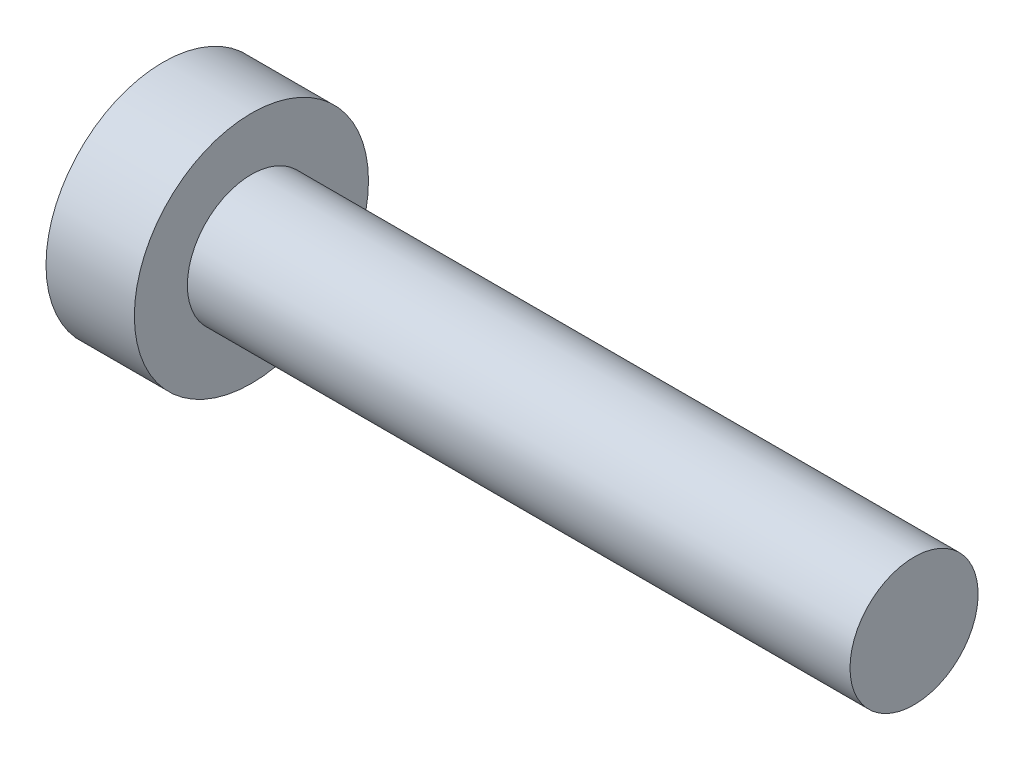
ISO-10303-21;
HEADER;
FILE_DESCRIPTION(('STEP AP214'),'2;1');
FILE_NAME('part.step','',(''),(''),'','','');
FILE_SCHEMA(('AUTOMOTIVE_DESIGN { 1 0 10303 214 1 1 1 1 }'));
ENDSEC;
DATA;
#1=APPLICATION_CONTEXT('core data for automotive mechanical design processes');
#2=APPLICATION_PROTOCOL_DEFINITION('international standard','automotive_design',2000,#1);
#3=PRODUCT_CONTEXT('',#1,'mechanical');
#4=PRODUCT('Part','Part','',(#3));
#5=PRODUCT_RELATED_PRODUCT_CATEGORY('part','',(#4));
#6=PRODUCT_DEFINITION_FORMATION('','',#4);
#7=PRODUCT_DEFINITION_CONTEXT('part definition',#1,'design');
#8=PRODUCT_DEFINITION('design','',#6,#7);
#9=PRODUCT_DEFINITION_SHAPE('','',#8);
#10=(LENGTH_UNIT() NAMED_UNIT(*) SI_UNIT(.MILLI.,.METRE.));
#11=(NAMED_UNIT(*) PLANE_ANGLE_UNIT() SI_UNIT($,.RADIAN.));
#12=(NAMED_UNIT(*) SI_UNIT($,.STERADIAN.) SOLID_ANGLE_UNIT());
#13=UNCERTAINTY_MEASURE_WITH_UNIT(LENGTH_MEASURE(1.E-05),#10,'distance_accuracy_value','');
#14=(GEOMETRIC_REPRESENTATION_CONTEXT(3) GLOBAL_UNCERTAINTY_ASSIGNED_CONTEXT((#13)) GLOBAL_UNIT_ASSIGNED_CONTEXT((#10,
#11,#12)) REPRESENTATION_CONTEXT('',''));
#15=CARTESIAN_POINT('',(0.,0.,0.));
#16=DIRECTION('',(0.,0.,1.));
#17=DIRECTION('',(1.,0.,0.));
#18=AXIS2_PLACEMENT_3D('',#15,#16,#17);
#19=CARTESIAN_POINT('',(0.,0.,0.));
#20=DIRECTION('',(1.,0.,0.));
#21=DIRECTION('',(0.,0.,-1.));
#22=AXIS2_PLACEMENT_3D('',#19,#20,#21);
#23=PLANE('',#22);
#24=CARTESIAN_POINT('',(0.,-1.45,0.));
#25=DIRECTION('',(-1.,0.,0.));
#26=DIRECTION('',(0.,0.,1.));
#27=AXIS2_PLACEMENT_3D('',#24,#25,#26);
#28=CIRCLE('',#27,2.65);
#29=CARTESIAN_POINT('',(0.,-1.45,2.65));
#30=VERTEX_POINT('',#29);
#31=EDGE_CURVE('E10',#30,#30,#28,.T.);
#32=ORIENTED_EDGE('',*,*,#31,.T.);
#33=EDGE_LOOP('',(#32));
#34=FACE_BOUND('',#33,.T.);
#35=ADVANCED_FACE('F32',(#34),#23,.F.);
#36=CARTESIAN_POINT('',(15.9186571646008,-1.45,0.));
#37=DIRECTION('',(-1.,0.,0.));
#38=DIRECTION('',(0.,0.,1.));
#39=AXIS2_PLACEMENT_3D('',#36,#37,#38);
#40=CYLINDRICAL_SURFACE('',#39,2.65);
#41=ORIENTED_EDGE('',*,*,#31,.F.);
#42=EDGE_LOOP('',(#41));
#43=FACE_BOUND('',#42,.T.);
#44=CARTESIAN_POINT('',(2.,-1.45,0.));
#45=DIRECTION('',(-1.,0.,0.));
#46=DIRECTION('',(0.,0.,1.));
#47=AXIS2_PLACEMENT_3D('',#44,#45,#46);
#48=CIRCLE('',#47,2.65);
#49=CARTESIAN_POINT('',(2.,-1.45,2.65));
#50=VERTEX_POINT('',#49);
#51=EDGE_CURVE('E39',#50,#50,#48,.T.);
#52=ORIENTED_EDGE('',*,*,#51,.T.);
#53=EDGE_LOOP('',(#52));
#54=FACE_BOUND('',#53,.T.);
#55=ADVANCED_FACE('F87',(#43,#54),#40,.T.);
#56=CARTESIAN_POINT('',(2.,1.2,0.));
#57=DIRECTION('',(-1.,0.,0.));
#58=DIRECTION('',(0.,0.,1.));
#59=AXIS2_PLACEMENT_3D('',#56,#57,#58);
#60=PLANE('',#59);
#61=ORIENTED_EDGE('',*,*,#51,.F.);
#62=EDGE_LOOP('',(#61));
#63=FACE_BOUND('',#62,.T.);
#64=CARTESIAN_POINT('',(2.,-1.45,0.));
#65=DIRECTION('',(-1.,0.,0.));
#66=DIRECTION('',(0.,0.,1.));
#67=AXIS2_PLACEMENT_3D('',#64,#65,#66);
#68=CIRCLE('',#67,1.45);
#69=CARTESIAN_POINT('',(2.,-1.45,1.45));
#70=VERTEX_POINT('',#69);
#71=EDGE_CURVE('E43',#70,#70,#68,.T.);
#72=ORIENTED_EDGE('',*,*,#71,.T.);
#73=EDGE_LOOP('',(#72));
#74=FACE_BOUND('',#73,.T.);
#75=ADVANCED_FACE('F84',(#63,#74),#60,.F.);
#76=CARTESIAN_POINT('',(15.9186571646008,-1.45,0.));
#77=DIRECTION('',(-1.,0.,0.));
#78=DIRECTION('',(0.,0.,1.));
#79=AXIS2_PLACEMENT_3D('',#76,#77,#78);
#80=CYLINDRICAL_SURFACE('',#79,1.45);
#81=ORIENTED_EDGE('',*,*,#71,.F.);
#82=EDGE_LOOP('',(#81));
#83=FACE_BOUND('',#82,.T.);
#84=CARTESIAN_POINT('',(17.,-1.45,0.));
#85=DIRECTION('',(-1.,0.,0.));
#86=DIRECTION('',(0.,0.,1.));
#87=AXIS2_PLACEMENT_3D('',#84,#85,#86);
#88=CIRCLE('',#87,1.45);
#89=CARTESIAN_POINT('',(17.,-1.45,1.45));
#90=VERTEX_POINT('',#89);
#91=EDGE_CURVE('E47',#90,#90,#88,.T.);
#92=ORIENTED_EDGE('',*,*,#91,.T.);
#93=EDGE_LOOP('',(#92));
#94=FACE_BOUND('',#93,.T.);
#95=ADVANCED_FACE('F80',(#83,#94),#80,.T.);
#96=CARTESIAN_POINT('',(17.,0.,0.));
#97=DIRECTION('',(-1.,0.,0.));
#98=DIRECTION('',(0.,0.,1.));
#99=AXIS2_PLACEMENT_3D('',#96,#97,#98);
#100=PLANE('',#99);
#101=ORIENTED_EDGE('',*,*,#91,.F.);
#102=EDGE_LOOP('',(#101));
#103=FACE_BOUND('',#102,.T.);
#104=ADVANCED_FACE('F78',(#103),#100,.F.);
#105=CLOSED_SHELL('',(#35,#55,#75,#95,#104));
#106=CARTESIAN_POINT('',(16.,0.,0.));
#107=DIRECTION('',(-1.,0.,0.));
#108=DIRECTION('',(0.,0.,1.));
#109=AXIS2_PLACEMENT_3D('',#106,#107,#108);
#110=PLANE('',#109);
#111=CARTESIAN_POINT('',(16.,-1.45,0.));
#112=DIRECTION('',(-1.,0.,0.));
#113=DIRECTION('',(0.,0.,1.));
#114=AXIS2_PLACEMENT_3D('',#111,#112,#113);
#115=CIRCLE('',#114,0.45);
#116=CARTESIAN_POINT('',(16.,-1.45,0.45));
#117=VERTEX_POINT('',#116);
#118=EDGE_CURVE('E52',#117,#117,#115,.T.);
#119=ORIENTED_EDGE('',*,*,#118,.T.);
#120=EDGE_LOOP('',(#119));
#121=FACE_BOUND('',#120,.T.);
#122=ADVANCED_FACE('F69',(#121),#110,.T.);
#123=CARTESIAN_POINT('',(15.9186571646008,-1.45,0.));
#124=DIRECTION('',(-1.,0.,0.));
#125=DIRECTION('',(0.,0.,1.));
#126=AXIS2_PLACEMENT_3D('',#123,#124,#125);
#127=CYLINDRICAL_SURFACE('',#126,0.45);
#128=CARTESIAN_POINT('',(1.,-1.45,0.));
#129=DIRECTION('',(-1.,0.,0.));
#130=DIRECTION('',(0.,0.,1.));
#131=AXIS2_PLACEMENT_3D('',#128,#129,#130);
#132=CIRCLE('',#131,0.45);
#133=CARTESIAN_POINT('',(1.,-1.45,0.45));
#134=VERTEX_POINT('',#133);
#135=EDGE_CURVE('E55',#134,#134,#132,.T.);
#136=ORIENTED_EDGE('',*,*,#135,.T.);
#137=EDGE_LOOP('',(#136));
#138=FACE_BOUND('',#137,.T.);
#139=ORIENTED_EDGE('',*,*,#118,.F.);
#140=EDGE_LOOP('',(#139));
#141=FACE_BOUND('',#140,.T.);
#142=ADVANCED_FACE('F59',(#138,#141),#127,.F.);
#143=CARTESIAN_POINT('',(1.,0.,0.));
#144=DIRECTION('',(1.,0.,0.));
#145=DIRECTION('',(0.,0.,-1.));
#146=AXIS2_PLACEMENT_3D('',#143,#144,#145);
#147=PLANE('',#146);
#148=ORIENTED_EDGE('',*,*,#135,.F.);
#149=EDGE_LOOP('',(#148));
#150=FACE_BOUND('',#149,.T.);
#151=ADVANCED_FACE('F62',(#150),#147,.T.);
#152=CLOSED_SHELL('',(#122,#142,#151));
#153=ORIENTED_CLOSED_SHELL('',*,#152,.T.);
#154=BREP_WITH_VOIDS('B2',#105,(#153));
#155=ADVANCED_BREP_SHAPE_REPRESENTATION('',(#18,#154),#14);
#156=SHAPE_DEFINITION_REPRESENTATION(#9,#155);
ENDSEC;
END-ISO-10303-21;
